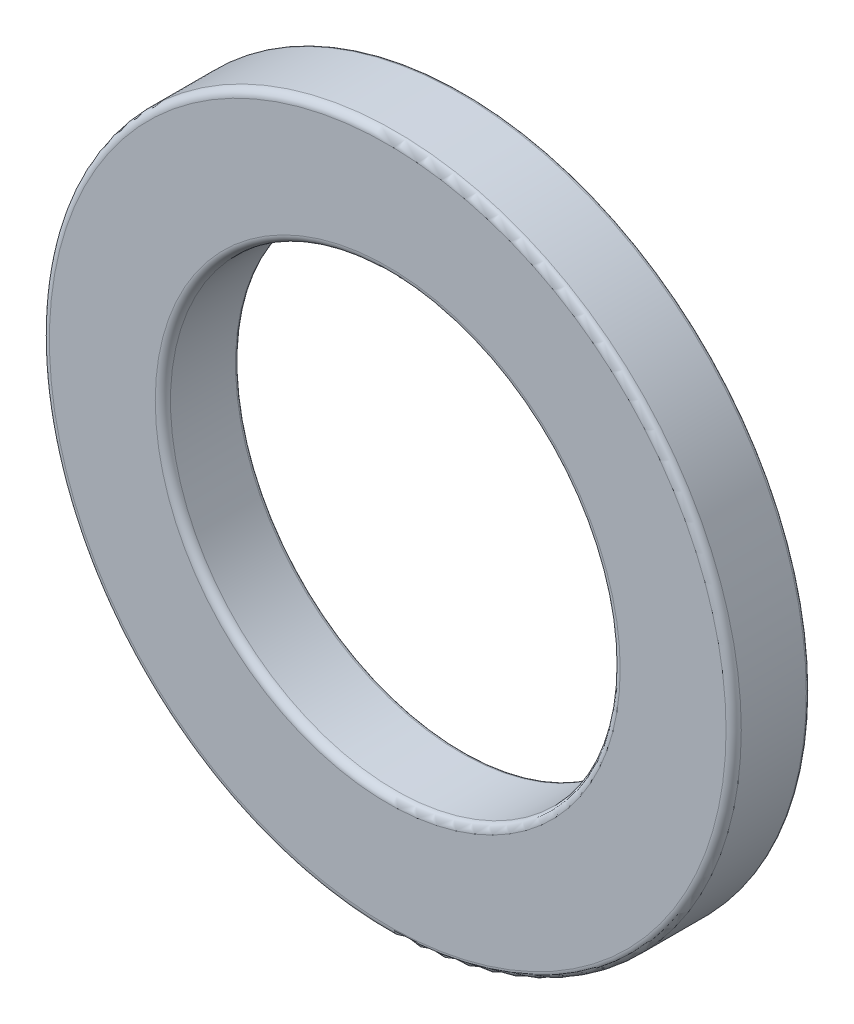
ISO-10303-21;
HEADER;
FILE_DESCRIPTION(('STEP AP214'),'2;1');
FILE_NAME('part.step','',(''),(''),'','','');
FILE_SCHEMA(('AUTOMOTIVE_DESIGN { 1 0 10303 214 1 1 1 1 }'));
ENDSEC;
DATA;
#1=APPLICATION_CONTEXT('core data for automotive mechanical design processes');
#2=APPLICATION_PROTOCOL_DEFINITION('international standard','automotive_design',2000,#1);
#3=PRODUCT_CONTEXT('',#1,'mechanical');
#4=PRODUCT('Part','Part','',(#3));
#5=PRODUCT_RELATED_PRODUCT_CATEGORY('part','',(#4));
#6=PRODUCT_DEFINITION_FORMATION('','',#4);
#7=PRODUCT_DEFINITION_CONTEXT('part definition',#1,'design');
#8=PRODUCT_DEFINITION('design','',#6,#7);
#9=PRODUCT_DEFINITION_SHAPE('','',#8);
#10=(LENGTH_UNIT() NAMED_UNIT(*) SI_UNIT(.MILLI.,.METRE.));
#11=(NAMED_UNIT(*) PLANE_ANGLE_UNIT() SI_UNIT($,.RADIAN.));
#12=(NAMED_UNIT(*) SI_UNIT($,.STERADIAN.) SOLID_ANGLE_UNIT());
#13=UNCERTAINTY_MEASURE_WITH_UNIT(LENGTH_MEASURE(1.E-05),#10,'distance_accuracy_value','');
#14=(GEOMETRIC_REPRESENTATION_CONTEXT(3) GLOBAL_UNCERTAINTY_ASSIGNED_CONTEXT((#13)) GLOBAL_UNIT_ASSIGNED_CONTEXT((#10,
#11,#12)) REPRESENTATION_CONTEXT('',''));
#15=CARTESIAN_POINT('',(0.,0.,0.));
#16=DIRECTION('',(0.,0.,1.));
#17=DIRECTION('',(1.,0.,0.));
#18=AXIS2_PLACEMENT_3D('',#15,#16,#17);
#19=CARTESIAN_POINT('',(0.,0.,-1.1));
#20=DIRECTION('',(0.,0.,1.));
#21=DIRECTION('',(1.,0.,0.));
#22=AXIS2_PLACEMENT_3D('',#19,#20,#21);
#23=CYLINDRICAL_SURFACE('',#22,10.);
#24=CARTESIAN_POINT('',(0.,0.,-1.));
#25=DIRECTION('',(0.,0.,1.));
#26=DIRECTION('',(1.,0.,0.));
#27=AXIS2_PLACEMENT_3D('',#24,#25,#26);
#28=CIRCLE('',#27,10.);
#29=CARTESIAN_POINT('',(10.,0.,-1.));
#30=VERTEX_POINT('',#29);
#31=EDGE_CURVE('E94',#30,#30,#28,.T.);
#32=ORIENTED_EDGE('',*,*,#31,.T.);
#33=EDGE_LOOP('',(#32));
#34=FACE_BOUND('',#33,.T.);
#35=CARTESIAN_POINT('',(0.,0.,0.88));
#36=DIRECTION('',(0.,0.,1.));
#37=DIRECTION('',(1.,0.,0.));
#38=AXIS2_PLACEMENT_3D('',#35,#36,#37);
#39=CIRCLE('',#38,10.);
#40=CARTESIAN_POINT('',(10.,0.,0.88));
#41=VERTEX_POINT('',#40);
#42=EDGE_CURVE('E99',#41,#41,#39,.F.);
#43=ORIENTED_EDGE('',*,*,#42,.T.);
#44=EDGE_LOOP('',(#43));
#45=FACE_BOUND('',#44,.T.);
#46=ADVANCED_FACE('F79',(#34,#45),#23,.T.);
#47=CARTESIAN_POINT('',(0.,0.,-1.1));
#48=DIRECTION('',(0.,0.,1.));
#49=DIRECTION('',(1.,0.,0.));
#50=AXIS2_PLACEMENT_3D('',#47,#48,#49);
#51=PLANE('',#50);
#52=CARTESIAN_POINT('',(0.,0.,-1.1));
#53=DIRECTION('',(0.,0.,1.));
#54=DIRECTION('',(1.,0.,0.));
#55=AXIS2_PLACEMENT_3D('',#52,#53,#54);
#56=CIRCLE('',#55,9.9);
#57=CARTESIAN_POINT('',(9.9,0.,-1.1));
#58=VERTEX_POINT('',#57);
#59=EDGE_CURVE('E86',#58,#58,#56,.F.);
#60=ORIENTED_EDGE('',*,*,#59,.T.);
#61=EDGE_LOOP('',(#60));
#62=FACE_BOUND('',#61,.T.);
#63=CARTESIAN_POINT('',(0.,0.,-1.1));
#64=DIRECTION('',(0.,0.,1.));
#65=DIRECTION('',(1.,0.,0.));
#66=AXIS2_PLACEMENT_3D('',#63,#64,#65);
#67=CIRCLE('',#66,6.6);
#68=CARTESIAN_POINT('',(6.6,0.,-1.1));
#69=VERTEX_POINT('',#68);
#70=EDGE_CURVE('E90',#69,#69,#67,.T.);
#71=ORIENTED_EDGE('',*,*,#70,.T.);
#72=EDGE_LOOP('',(#71));
#73=FACE_BOUND('',#72,.T.);
#74=ADVANCED_FACE('F132',(#62,#73),#51,.F.);
#75=CARTESIAN_POINT('',(0.,0.,-1.1));
#76=DIRECTION('',(0.,0.,1.));
#77=DIRECTION('',(1.,0.,0.));
#78=AXIS2_PLACEMENT_3D('',#75,#76,#77);
#79=CYLINDRICAL_SURFACE('',#78,6.5);
#80=CARTESIAN_POINT('',(0.,0.,-1.));
#81=DIRECTION('',(0.,0.,1.));
#82=DIRECTION('',(1.,0.,0.));
#83=AXIS2_PLACEMENT_3D('',#80,#81,#82);
#84=CIRCLE('',#83,6.5);
#85=CARTESIAN_POINT('',(6.5,0.,-1.));
#86=VERTEX_POINT('',#85);
#87=EDGE_CURVE('E11',#86,#86,#84,.F.);
#88=ORIENTED_EDGE('',*,*,#87,.T.);
#89=EDGE_LOOP('',(#88));
#90=FACE_BOUND('',#89,.T.);
#91=CARTESIAN_POINT('',(0.,0.,0.88));
#92=DIRECTION('',(0.,0.,1.));
#93=DIRECTION('',(1.,0.,0.));
#94=AXIS2_PLACEMENT_3D('',#91,#92,#93);
#95=CIRCLE('',#94,6.5);
#96=CARTESIAN_POINT('',(6.5,0.,0.88));
#97=VERTEX_POINT('',#96);
#98=EDGE_CURVE('E108',#97,#97,#95,.T.);
#99=ORIENTED_EDGE('',*,*,#98,.T.);
#100=EDGE_LOOP('',(#99));
#101=FACE_BOUND('',#100,.T.);
#102=ADVANCED_FACE('F112',(#90,#101),#79,.F.);
#103=CARTESIAN_POINT('',(0.,0.,1.1));
#104=DIRECTION('',(0.,0.,1.));
#105=DIRECTION('',(1.,0.,0.));
#106=AXIS2_PLACEMENT_3D('',#103,#104,#105);
#107=PLANE('',#106);
#108=CARTESIAN_POINT('',(0.,0.,1.1));
#109=DIRECTION('',(0.,0.,1.));
#110=DIRECTION('',(1.,0.,0.));
#111=AXIS2_PLACEMENT_3D('',#108,#109,#110);
#112=CIRCLE('',#111,6.72);
#113=CARTESIAN_POINT('',(6.72,0.,1.1));
#114=VERTEX_POINT('',#113);
#115=EDGE_CURVE('E102',#114,#114,#112,.F.);
#116=ORIENTED_EDGE('',*,*,#115,.T.);
#117=EDGE_LOOP('',(#116));
#118=FACE_BOUND('',#117,.T.);
#119=CARTESIAN_POINT('',(0.,0.,1.1));
#120=DIRECTION('',(0.,0.,1.));
#121=DIRECTION('',(1.,0.,0.));
#122=AXIS2_PLACEMENT_3D('',#119,#120,#121);
#123=CIRCLE('',#122,9.78);
#124=CARTESIAN_POINT('',(9.78,0.,1.1));
#125=VERTEX_POINT('',#124);
#126=EDGE_CURVE('E105',#125,#125,#123,.T.);
#127=ORIENTED_EDGE('',*,*,#126,.T.);
#128=EDGE_LOOP('',(#127));
#129=FACE_BOUND('',#128,.T.);
#130=ADVANCED_FACE('F117',(#118,#129),#107,.T.);
#131=CARTESIAN_POINT('',(0.,0.,0.88));
#132=DIRECTION('',(0.,0.,1.));
#133=DIRECTION('',(1.,0.,0.));
#134=AXIS2_PLACEMENT_3D('',#131,#132,#133);
#135=TOROIDAL_SURFACE('',#134,6.72,0.22);
#136=ORIENTED_EDGE('',*,*,#115,.F.);
#137=EDGE_LOOP('',(#136));
#138=FACE_BOUND('',#137,.T.);
#139=ORIENTED_EDGE('',*,*,#98,.F.);
#140=EDGE_LOOP('',(#139));
#141=FACE_BOUND('',#140,.T.);
#142=ADVANCED_FACE('F114',(#138,#141),#135,.T.);
#143=CARTESIAN_POINT('',(0.,0.,0.88));
#144=DIRECTION('',(0.,0.,1.));
#145=DIRECTION('',(1.,0.,0.));
#146=AXIS2_PLACEMENT_3D('',#143,#144,#145);
#147=TOROIDAL_SURFACE('',#146,9.78,0.22);
#148=ORIENTED_EDGE('',*,*,#42,.F.);
#149=EDGE_LOOP('',(#148));
#150=FACE_BOUND('',#149,.T.);
#151=ORIENTED_EDGE('',*,*,#126,.F.);
#152=EDGE_LOOP('',(#151));
#153=FACE_BOUND('',#152,.T.);
#154=ADVANCED_FACE('F116',(#150,#153),#147,.T.);
#155=CARTESIAN_POINT('',(0.,0.,-1.));
#156=DIRECTION('',(0.,0.,1.));
#157=DIRECTION('',(1.,0.,0.));
#158=AXIS2_PLACEMENT_3D('',#155,#156,#157);
#159=TOROIDAL_SURFACE('',#158,9.9,0.1);
#160=ORIENTED_EDGE('',*,*,#59,.F.);
#161=EDGE_LOOP('',(#160));
#162=FACE_BOUND('',#161,.T.);
#163=ORIENTED_EDGE('',*,*,#31,.F.);
#164=EDGE_LOOP('',(#163));
#165=FACE_BOUND('',#164,.T.);
#166=ADVANCED_FACE('F124',(#162,#165),#159,.T.);
#167=CARTESIAN_POINT('',(0.,0.,-1.));
#168=DIRECTION('',(0.,0.,1.));
#169=DIRECTION('',(1.,0.,0.));
#170=AXIS2_PLACEMENT_3D('',#167,#168,#169);
#171=TOROIDAL_SURFACE('',#170,6.6,0.1);
#172=ORIENTED_EDGE('',*,*,#87,.F.);
#173=EDGE_LOOP('',(#172));
#174=FACE_BOUND('',#173,.T.);
#175=ORIENTED_EDGE('',*,*,#70,.F.);
#176=EDGE_LOOP('',(#175));
#177=FACE_BOUND('',#176,.T.);
#178=ADVANCED_FACE('F81',(#174,#177),#171,.T.);
#179=CLOSED_SHELL('',(#46,#74,#102,#130,#142,#154,#166,#178));
#180=MANIFOLD_SOLID_BREP('B2',#179);
#181=ADVANCED_BREP_SHAPE_REPRESENTATION('',(#18,#180),#14);
#182=SHAPE_DEFINITION_REPRESENTATION(#9,#181);
ENDSEC;
END-ISO-10303-21;
